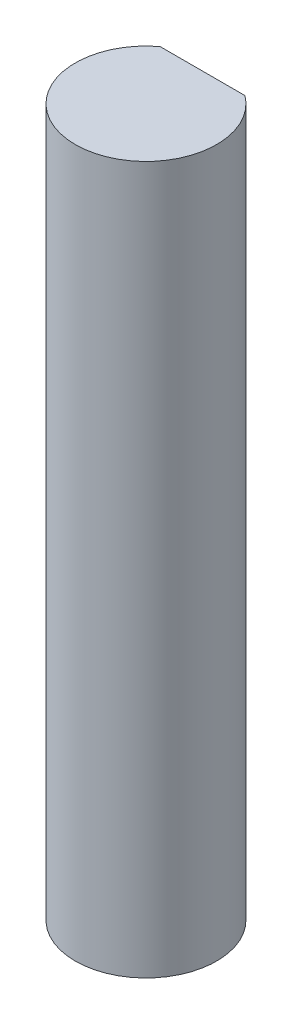
ISO-10303-21;
HEADER;
FILE_DESCRIPTION(('STEP AP214'),'2;1');
FILE_NAME('part.step','',(''),(''),'','','');
FILE_SCHEMA(('AUTOMOTIVE_DESIGN { 1 0 10303 214 1 1 1 1 }'));
ENDSEC;
DATA;
#1=APPLICATION_CONTEXT('core data for automotive mechanical design processes');
#2=APPLICATION_PROTOCOL_DEFINITION('international standard','automotive_design',2000,#1);
#3=PRODUCT_CONTEXT('',#1,'mechanical');
#4=PRODUCT('Part','Part','',(#3));
#5=PRODUCT_RELATED_PRODUCT_CATEGORY('part','',(#4));
#6=PRODUCT_DEFINITION_FORMATION('','',#4);
#7=PRODUCT_DEFINITION_CONTEXT('part definition',#1,'design');
#8=PRODUCT_DEFINITION('design','',#6,#7);
#9=PRODUCT_DEFINITION_SHAPE('','',#8);
#10=(LENGTH_UNIT() NAMED_UNIT(*) SI_UNIT(.MILLI.,.METRE.));
#11=(NAMED_UNIT(*) PLANE_ANGLE_UNIT() SI_UNIT($,.RADIAN.));
#12=(NAMED_UNIT(*) SI_UNIT($,.STERADIAN.) SOLID_ANGLE_UNIT());
#13=UNCERTAINTY_MEASURE_WITH_UNIT(LENGTH_MEASURE(1.E-05),#10,'distance_accuracy_value','');
#14=(GEOMETRIC_REPRESENTATION_CONTEXT(3) GLOBAL_UNCERTAINTY_ASSIGNED_CONTEXT((#13)) GLOBAL_UNIT_ASSIGNED_CONTEXT((#10,
#11,#12)) REPRESENTATION_CONTEXT('',''));
#15=CARTESIAN_POINT('',(0.,0.,0.));
#16=DIRECTION('',(0.,0.,1.));
#17=DIRECTION('',(1.,0.,0.));
#18=AXIS2_PLACEMENT_3D('',#15,#16,#17);
#19=CARTESIAN_POINT('',(0.,31.75,0.));
#20=DIRECTION('',(0.,-1.,0.));
#21=DIRECTION('',(0.,0.,-1.));
#22=AXIS2_PLACEMENT_3D('',#19,#20,#21);
#23=CYLINDRICAL_SURFACE('',#22,3.175);
#24=CARTESIAN_POINT('',(0.,0.,0.));
#25=DIRECTION('',(0.,1.,0.));
#26=DIRECTION('',(0.,0.,1.));
#27=AXIS2_PLACEMENT_3D('',#24,#25,#26);
#28=CIRCLE('',#27,3.175);
#29=CARTESIAN_POINT('',(-1.905,0.,-2.54));
#30=VERTEX_POINT('',#29);
#31=CARTESIAN_POINT('',(1.905,0.,-2.54));
#32=VERTEX_POINT('',#31);
#33=EDGE_CURVE('E64',#30,#32,#28,.T.);
#34=ORIENTED_EDGE('',*,*,#33,.T.);
#35=DIRECTION('',(0.,-1.,0.));
#36=VECTOR('',#35,1.);
#37=CARTESIAN_POINT('',(1.905,31.75,-2.54));
#38=LINE('',#37,#36);
#39=CARTESIAN_POINT('',(1.905,31.75,-2.54));
#40=VERTEX_POINT('',#39);
#41=EDGE_CURVE('E11',#40,#32,#38,.T.);
#42=ORIENTED_EDGE('',*,*,#41,.F.);
#43=CARTESIAN_POINT('',(0.,31.75,0.));
#44=DIRECTION('',(0.,1.,0.));
#45=DIRECTION('',(0.,0.,1.));
#46=AXIS2_PLACEMENT_3D('',#43,#44,#45);
#47=CIRCLE('',#46,3.175);
#48=CARTESIAN_POINT('',(-1.905,31.75,-2.54));
#49=VERTEX_POINT('',#48);
#50=EDGE_CURVE('E63',#49,#40,#47,.T.);
#51=ORIENTED_EDGE('',*,*,#50,.F.);
#52=DIRECTION('',(0.,-1.,0.));
#53=VECTOR('',#52,1.);
#54=CARTESIAN_POINT('',(-1.905,31.75,-2.54));
#55=LINE('',#54,#53);
#56=EDGE_CURVE('E41',#49,#30,#55,.T.);
#57=ORIENTED_EDGE('',*,*,#56,.T.);
#58=EDGE_LOOP('',(#34,#42,#51,#57));
#59=FACE_BOUND('',#58,.T.);
#60=ADVANCED_FACE('F33',(#59),#23,.T.);
#61=CARTESIAN_POINT('',(-1.905,31.75,-2.54));
#62=DIRECTION('',(0.,0.,1.));
#63=DIRECTION('',(1.,0.,0.));
#64=AXIS2_PLACEMENT_3D('',#61,#62,#63);
#65=PLANE('',#64);
#66=DIRECTION('',(-1.,0.,0.));
#67=VECTOR('',#66,1.);
#68=CARTESIAN_POINT('',(-1.905,0.,-2.54));
#69=LINE('',#68,#67);
#70=EDGE_CURVE('E56',#32,#30,#69,.T.);
#71=ORIENTED_EDGE('',*,*,#70,.T.);
#72=ORIENTED_EDGE('',*,*,#56,.F.);
#73=DIRECTION('',(-1.,0.,0.));
#74=VECTOR('',#73,1.);
#75=CARTESIAN_POINT('',(-1.905,31.75,-2.54));
#76=LINE('',#75,#74);
#77=EDGE_CURVE('E48',#40,#49,#76,.T.);
#78=ORIENTED_EDGE('',*,*,#77,.F.);
#79=ORIENTED_EDGE('',*,*,#41,.T.);
#80=EDGE_LOOP('',(#71,#72,#78,#79));
#81=FACE_BOUND('',#80,.T.);
#82=ADVANCED_FACE('F59',(#81),#65,.F.);
#83=CARTESIAN_POINT('',(0.,31.75,0.));
#84=DIRECTION('',(0.,1.,0.));
#85=DIRECTION('',(0.,0.,1.));
#86=AXIS2_PLACEMENT_3D('',#83,#84,#85);
#87=PLANE('',#86);
#88=ORIENTED_EDGE('',*,*,#50,.T.);
#89=ORIENTED_EDGE('',*,*,#77,.T.);
#90=EDGE_LOOP('',(#88,#89));
#91=FACE_BOUND('',#90,.T.);
#92=ADVANCED_FACE('F71',(#91),#87,.T.);
#93=CARTESIAN_POINT('',(0.,0.,0.));
#94=DIRECTION('',(0.,1.,0.));
#95=DIRECTION('',(0.,0.,1.));
#96=AXIS2_PLACEMENT_3D('',#93,#94,#95);
#97=PLANE('',#96);
#98=ORIENTED_EDGE('',*,*,#33,.F.);
#99=ORIENTED_EDGE('',*,*,#70,.F.);
#100=EDGE_LOOP('',(#98,#99));
#101=FACE_BOUND('',#100,.T.);
#102=ADVANCED_FACE('F67',(#101),#97,.F.);
#103=CLOSED_SHELL('',(#60,#82,#92,#102));
#104=MANIFOLD_SOLID_BREP('B2',#103);
#105=ADVANCED_BREP_SHAPE_REPRESENTATION('',(#18,#104),#14);
#106=SHAPE_DEFINITION_REPRESENTATION(#9,#105);
ENDSEC;
END-ISO-10303-21;
